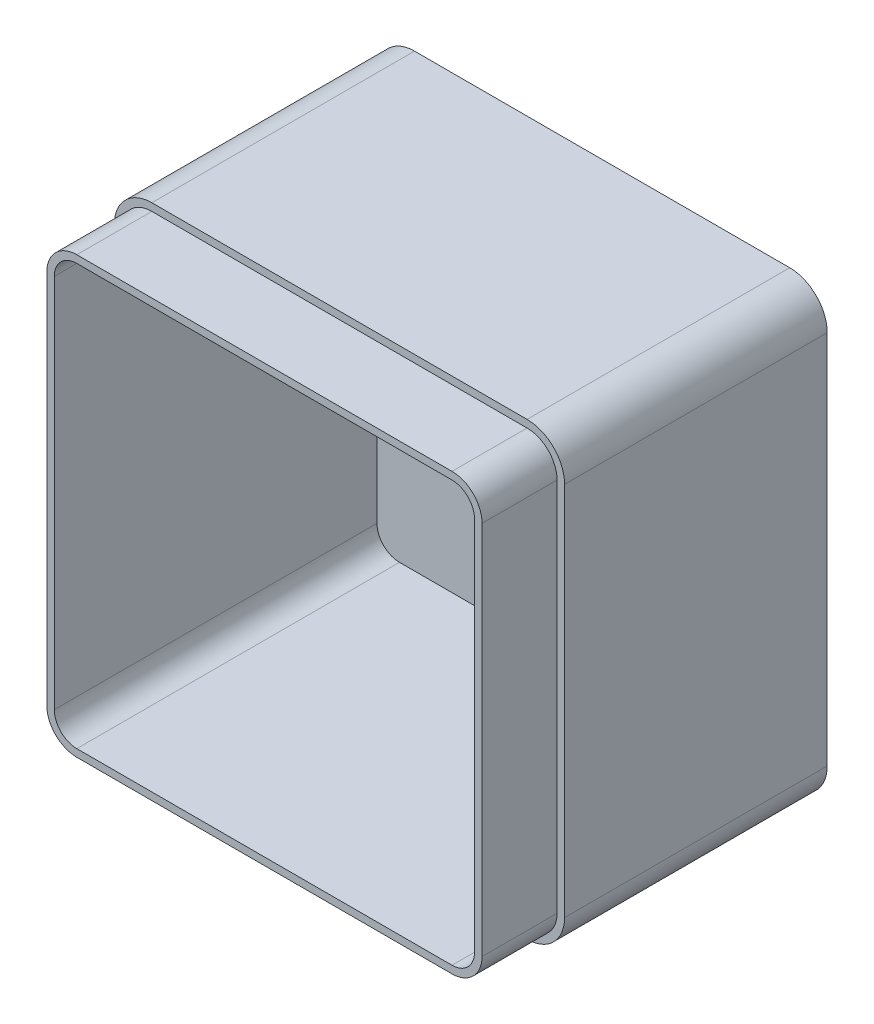
ISO-10303-21;
HEADER;
FILE_DESCRIPTION(('STEP AP214'),'2;1');
FILE_NAME('part.step','',(''),(''),'','','');
FILE_SCHEMA(('AUTOMOTIVE_DESIGN { 1 0 10303 214 1 1 1 1 }'));
ENDSEC;
DATA;
#1=APPLICATION_CONTEXT('core data for automotive mechanical design processes');
#2=APPLICATION_PROTOCOL_DEFINITION('international standard','automotive_design',2000,#1);
#3=PRODUCT_CONTEXT('',#1,'mechanical');
#4=PRODUCT('Part','Part','',(#3));
#5=PRODUCT_RELATED_PRODUCT_CATEGORY('part','',(#4));
#6=PRODUCT_DEFINITION_FORMATION('','',#4);
#7=PRODUCT_DEFINITION_CONTEXT('part definition',#1,'design');
#8=PRODUCT_DEFINITION('design','',#6,#7);
#9=PRODUCT_DEFINITION_SHAPE('','',#8);
#10=(LENGTH_UNIT() NAMED_UNIT(*) SI_UNIT(.MILLI.,.METRE.));
#11=(NAMED_UNIT(*) PLANE_ANGLE_UNIT() SI_UNIT($,.RADIAN.));
#12=(NAMED_UNIT(*) SI_UNIT($,.STERADIAN.) SOLID_ANGLE_UNIT());
#13=UNCERTAINTY_MEASURE_WITH_UNIT(LENGTH_MEASURE(1.E-05),#10,'distance_accuracy_value','');
#14=(GEOMETRIC_REPRESENTATION_CONTEXT(3) GLOBAL_UNCERTAINTY_ASSIGNED_CONTEXT((#13)) GLOBAL_UNIT_ASSIGNED_CONTEXT((#10,
#11,#12)) REPRESENTATION_CONTEXT('',''));
#15=CARTESIAN_POINT('',(0.,0.,0.));
#16=DIRECTION('',(0.,0.,1.));
#17=DIRECTION('',(1.,0.,0.));
#18=AXIS2_PLACEMENT_3D('',#15,#16,#17);
#19=CARTESIAN_POINT('',(0.,0.,90.));
#20=DIRECTION('',(0.,0.,1.));
#21=DIRECTION('',(1.,0.,0.));
#22=AXIS2_PLACEMENT_3D('',#19,#20,#21);
#23=PLANE('',#22);
#24=DIRECTION('',(0.,-1.,0.));
#25=VECTOR('',#24,1.);
#26=CARTESIAN_POINT('',(-56.,60.,90.));
#27=LINE('',#26,#25);
#28=CARTESIAN_POINT('',(-56.,50.,90.));
#29=VERTEX_POINT('',#28);
#30=CARTESIAN_POINT('',(-56.,-50.,90.));
#31=VERTEX_POINT('',#30);
#32=EDGE_CURVE('E391',#29,#31,#27,.T.);
#33=ORIENTED_EDGE('',*,*,#32,.F.);
#34=CARTESIAN_POINT('',(-50.,50.,90.));
#35=DIRECTION('',(0.,0.,1.));
#36=DIRECTION('',(1.,0.,0.));
#37=AXIS2_PLACEMENT_3D('',#34,#35,#36);
#38=CIRCLE('',#37,6.);
#39=CARTESIAN_POINT('',(-50.,56.,90.));
#40=VERTEX_POINT('',#39);
#41=EDGE_CURVE('E388',#40,#29,#38,.T.);
#42=ORIENTED_EDGE('',*,*,#41,.F.);
#43=DIRECTION('',(-1.,0.,0.));
#44=VECTOR('',#43,1.);
#45=CARTESIAN_POINT('',(-60.,56.,90.));
#46=LINE('',#45,#44);
#47=CARTESIAN_POINT('',(50.,56.,90.));
#48=VERTEX_POINT('',#47);
#49=EDGE_CURVE('E385',#48,#40,#46,.T.);
#50=ORIENTED_EDGE('',*,*,#49,.F.);
#51=CARTESIAN_POINT('',(50.,50.,90.));
#52=DIRECTION('',(0.,0.,1.));
#53=DIRECTION('',(1.,0.,0.));
#54=AXIS2_PLACEMENT_3D('',#51,#52,#53);
#55=CIRCLE('',#54,6.);
#56=CARTESIAN_POINT('',(56.,50.,90.));
#57=VERTEX_POINT('',#56);
#58=EDGE_CURVE('E374',#57,#48,#55,.T.);
#59=ORIENTED_EDGE('',*,*,#58,.F.);
#60=DIRECTION('',(0.,1.,0.));
#61=VECTOR('',#60,1.);
#62=CARTESIAN_POINT('',(56.,60.,90.));
#63=LINE('',#62,#61);
#64=CARTESIAN_POINT('',(56.,-50.,90.));
#65=VERTEX_POINT('',#64);
#66=EDGE_CURVE('E338',#65,#57,#63,.T.);
#67=ORIENTED_EDGE('',*,*,#66,.F.);
#68=CARTESIAN_POINT('',(50.,-50.,90.));
#69=DIRECTION('',(0.,0.,1.));
#70=DIRECTION('',(1.,0.,0.));
#71=AXIS2_PLACEMENT_3D('',#68,#69,#70);
#72=CIRCLE('',#71,6.);
#73=CARTESIAN_POINT('',(50.,-56.,90.));
#74=VERTEX_POINT('',#73);
#75=EDGE_CURVE('E394',#74,#65,#72,.T.);
#76=ORIENTED_EDGE('',*,*,#75,.F.);
#77=DIRECTION('',(1.,0.,0.));
#78=VECTOR('',#77,1.);
#79=CARTESIAN_POINT('',(-60.,-56.,90.));
#80=LINE('',#79,#78);
#81=CARTESIAN_POINT('',(-50.,-56.,90.));
#82=VERTEX_POINT('',#81);
#83=EDGE_CURVE('E381',#82,#74,#80,.T.);
#84=ORIENTED_EDGE('',*,*,#83,.F.);
#85=CARTESIAN_POINT('',(-50.,-50.,90.));
#86=DIRECTION('',(0.,0.,1.));
#87=DIRECTION('',(1.,0.,0.));
#88=AXIS2_PLACEMENT_3D('',#85,#86,#87);
#89=CIRCLE('',#88,6.);
#90=EDGE_CURVE('E333',#31,#82,#89,.T.);
#91=ORIENTED_EDGE('',*,*,#90,.F.);
#92=EDGE_LOOP('',(#33,#42,#50,#59,#67,#76,#84,#91));
#93=FACE_BOUND('',#92,.T.);
#94=DIRECTION('',(-1.,0.,0.));
#95=VECTOR('',#94,1.);
#96=CARTESIAN_POINT('',(50.,58.,90.));
#97=LINE('',#96,#95);
#98=CARTESIAN_POINT('',(50.,58.,90.));
#99=VERTEX_POINT('',#98);
#100=CARTESIAN_POINT('',(-50.,58.,90.));
#101=VERTEX_POINT('',#100);
#102=EDGE_CURVE('E229',#99,#101,#97,.T.);
#103=ORIENTED_EDGE('',*,*,#102,.T.);
#104=CARTESIAN_POINT('',(-50.,50.,90.));
#105=DIRECTION('',(0.,0.,1.));
#106=DIRECTION('',(1.,0.,0.));
#107=AXIS2_PLACEMENT_3D('',#104,#105,#106);
#108=CIRCLE('',#107,7.99999999999999);
#109=CARTESIAN_POINT('',(-58.,50.,90.));
#110=VERTEX_POINT('',#109);
#111=EDGE_CURVE('E256',#101,#110,#108,.T.);
#112=ORIENTED_EDGE('',*,*,#111,.T.);
#113=DIRECTION('',(0.,-1.,0.));
#114=VECTOR('',#113,1.);
#115=CARTESIAN_POINT('',(-58.,50.,90.));
#116=LINE('',#115,#114);
#117=CARTESIAN_POINT('',(-58.,-50.,90.));
#118=VERTEX_POINT('',#117);
#119=EDGE_CURVE('E206',#110,#118,#116,.T.);
#120=ORIENTED_EDGE('',*,*,#119,.T.);
#121=CARTESIAN_POINT('',(-50.,-50.,90.));
#122=DIRECTION('',(0.,0.,1.));
#123=DIRECTION('',(1.,0.,0.));
#124=AXIS2_PLACEMENT_3D('',#121,#122,#123);
#125=CIRCLE('',#124,8.);
#126=CARTESIAN_POINT('',(-50.,-58.,90.));
#127=VERTEX_POINT('',#126);
#128=EDGE_CURVE('E54',#118,#127,#125,.T.);
#129=ORIENTED_EDGE('',*,*,#128,.T.);
#130=DIRECTION('',(1.,0.,0.));
#131=VECTOR('',#130,1.);
#132=CARTESIAN_POINT('',(-50.,-58.,90.));
#133=LINE('',#132,#131);
#134=CARTESIAN_POINT('',(50.,-58.,90.));
#135=VERTEX_POINT('',#134);
#136=EDGE_CURVE('E263',#127,#135,#133,.T.);
#137=ORIENTED_EDGE('',*,*,#136,.T.);
#138=CARTESIAN_POINT('',(50.,-50.,90.));
#139=DIRECTION('',(0.,0.,1.));
#140=DIRECTION('',(1.,0.,0.));
#141=AXIS2_PLACEMENT_3D('',#138,#139,#140);
#142=CIRCLE('',#141,7.99999999999999);
#143=CARTESIAN_POINT('',(58.,-50.,90.));
#144=VERTEX_POINT('',#143);
#145=EDGE_CURVE('E267',#135,#144,#142,.T.);
#146=ORIENTED_EDGE('',*,*,#145,.T.);
#147=DIRECTION('',(0.,1.,0.));
#148=VECTOR('',#147,1.);
#149=CARTESIAN_POINT('',(58.,-50.,90.));
#150=LINE('',#149,#148);
#151=CARTESIAN_POINT('',(58.,50.,90.));
#152=VERTEX_POINT('',#151);
#153=EDGE_CURVE('E271',#144,#152,#150,.T.);
#154=ORIENTED_EDGE('',*,*,#153,.T.);
#155=CARTESIAN_POINT('',(50.,50.,90.));
#156=DIRECTION('',(0.,0.,1.));
#157=DIRECTION('',(1.,0.,0.));
#158=AXIS2_PLACEMENT_3D('',#155,#156,#157);
#159=CIRCLE('',#158,8.);
#160=EDGE_CURVE('E233',#152,#99,#159,.T.);
#161=ORIENTED_EDGE('',*,*,#160,.T.);
#162=EDGE_LOOP('',(#103,#112,#120,#129,#137,#146,#154,#161));
#163=FACE_BOUND('',#162,.T.);
#164=ADVANCED_FACE('F38',(#93,#163),#23,.T.);
#165=CARTESIAN_POINT('',(56.,60.,90.));
#166=DIRECTION('',(-1.,0.,0.));
#167=DIRECTION('',(0.,-1.,0.));
#168=AXIS2_PLACEMENT_3D('',#165,#166,#167);
#169=PLANE('',#168);
#170=ORIENTED_EDGE('',*,*,#66,.T.);
#171=DIRECTION('',(0.,0.,1.));
#172=VECTOR('',#171,1.);
#173=CARTESIAN_POINT('',(56.,50.,90.));
#174=LINE('',#173,#172);
#175=CARTESIAN_POINT('',(56.,50.,4.));
#176=VERTEX_POINT('',#175);
#177=EDGE_CURVE('E326',#176,#57,#174,.T.);
#178=ORIENTED_EDGE('',*,*,#177,.F.);
#179=DIRECTION('',(0.,1.,0.));
#180=VECTOR('',#179,1.);
#181=CARTESIAN_POINT('',(56.,60.,4.));
#182=LINE('',#181,#180);
#183=CARTESIAN_POINT('',(56.,-50.,4.));
#184=VERTEX_POINT('',#183);
#185=EDGE_CURVE('E320',#184,#176,#182,.T.);
#186=ORIENTED_EDGE('',*,*,#185,.F.);
#187=DIRECTION('',(0.,0.,1.));
#188=VECTOR('',#187,1.);
#189=CARTESIAN_POINT('',(56.,-50.,90.));
#190=LINE('',#189,#188);
#191=EDGE_CURVE('E321',#65,#184,#190,.F.);
#192=ORIENTED_EDGE('',*,*,#191,.F.);
#193=EDGE_LOOP('',(#170,#178,#186,#192));
#194=FACE_BOUND('',#193,.T.);
#195=ADVANCED_FACE('F500',(#194),#169,.T.);
#196=CARTESIAN_POINT('',(-60.,56.,90.));
#197=DIRECTION('',(0.,-1.,0.));
#198=DIRECTION('',(0.,0.,-1.));
#199=AXIS2_PLACEMENT_3D('',#196,#197,#198);
#200=PLANE('',#199);
#201=DIRECTION('',(-1.,0.,0.));
#202=VECTOR('',#201,1.);
#203=CARTESIAN_POINT('',(-60.,56.,4.));
#204=LINE('',#203,#202);
#205=CARTESIAN_POINT('',(50.,56.,4.));
#206=VERTEX_POINT('',#205);
#207=CARTESIAN_POINT('',(-50.,56.,4.));
#208=VERTEX_POINT('',#207);
#209=EDGE_CURVE('E330',#206,#208,#204,.T.);
#210=ORIENTED_EDGE('',*,*,#209,.F.);
#211=DIRECTION('',(0.,0.,-1.));
#212=VECTOR('',#211,1.);
#213=CARTESIAN_POINT('',(50.,56.,90.));
#214=LINE('',#213,#212);
#215=EDGE_CURVE('E325',#48,#206,#214,.T.);
#216=ORIENTED_EDGE('',*,*,#215,.F.);
#217=ORIENTED_EDGE('',*,*,#49,.T.);
#218=DIRECTION('',(0.,0.,-1.));
#219=VECTOR('',#218,1.);
#220=CARTESIAN_POINT('',(-50.,56.,90.));
#221=LINE('',#220,#219);
#222=EDGE_CURVE('E360',#208,#40,#221,.F.);
#223=ORIENTED_EDGE('',*,*,#222,.F.);
#224=EDGE_LOOP('',(#210,#216,#217,#223));
#225=FACE_BOUND('',#224,.T.);
#226=ADVANCED_FACE('F508',(#225),#200,.T.);
#227=CARTESIAN_POINT('',(-56.,60.,90.));
#228=DIRECTION('',(1.,0.,0.));
#229=DIRECTION('',(0.,1.,0.));
#230=AXIS2_PLACEMENT_3D('',#227,#228,#229);
#231=PLANE('',#230);
#232=DIRECTION('',(0.,-1.,0.));
#233=VECTOR('',#232,1.);
#234=CARTESIAN_POINT('',(-56.,60.,4.));
#235=LINE('',#234,#233);
#236=CARTESIAN_POINT('',(-56.,50.,4.));
#237=VERTEX_POINT('',#236);
#238=CARTESIAN_POINT('',(-56.,-50.,4.));
#239=VERTEX_POINT('',#238);
#240=EDGE_CURVE('E339',#237,#239,#235,.T.);
#241=ORIENTED_EDGE('',*,*,#240,.F.);
#242=DIRECTION('',(0.,0.,1.));
#243=VECTOR('',#242,1.);
#244=CARTESIAN_POINT('',(-56.,50.,90.));
#245=LINE('',#244,#243);
#246=EDGE_CURVE('E343',#29,#237,#245,.F.);
#247=ORIENTED_EDGE('',*,*,#246,.F.);
#248=ORIENTED_EDGE('',*,*,#32,.T.);
#249=DIRECTION('',(0.,0.,1.));
#250=VECTOR('',#249,1.);
#251=CARTESIAN_POINT('',(-56.,-50.,90.));
#252=LINE('',#251,#250);
#253=EDGE_CURVE('E371',#239,#31,#252,.T.);
#254=ORIENTED_EDGE('',*,*,#253,.F.);
#255=EDGE_LOOP('',(#241,#247,#248,#254));
#256=FACE_BOUND('',#255,.T.);
#257=ADVANCED_FACE('F646',(#256),#231,.T.);
#258=CARTESIAN_POINT('',(-60.,-56.,90.));
#259=DIRECTION('',(0.,1.,0.));
#260=DIRECTION('',(0.,0.,1.));
#261=AXIS2_PLACEMENT_3D('',#258,#259,#260);
#262=PLANE('',#261);
#263=ORIENTED_EDGE('',*,*,#83,.T.);
#264=DIRECTION('',(0.,0.,1.));
#265=VECTOR('',#264,1.);
#266=CARTESIAN_POINT('',(50.,-56.,90.));
#267=LINE('',#266,#265);
#268=CARTESIAN_POINT('',(50.,-56.,4.));
#269=VERTEX_POINT('',#268);
#270=EDGE_CURVE('E378',#269,#74,#267,.T.);
#271=ORIENTED_EDGE('',*,*,#270,.F.);
#272=DIRECTION('',(1.,0.,0.));
#273=VECTOR('',#272,1.);
#274=CARTESIAN_POINT('',(-60.,-56.,4.));
#275=LINE('',#274,#273);
#276=CARTESIAN_POINT('',(-50.,-56.,4.));
#277=VERTEX_POINT('',#276);
#278=EDGE_CURVE('E334',#277,#269,#275,.T.);
#279=ORIENTED_EDGE('',*,*,#278,.F.);
#280=DIRECTION('',(0.,0.,1.));
#281=VECTOR('',#280,1.);
#282=CARTESIAN_POINT('',(-50.,-56.,90.));
#283=LINE('',#282,#281);
#284=EDGE_CURVE('E357',#82,#277,#283,.F.);
#285=ORIENTED_EDGE('',*,*,#284,.F.);
#286=EDGE_LOOP('',(#263,#271,#279,#285));
#287=FACE_BOUND('',#286,.T.);
#288=ADVANCED_FACE('F650',(#287),#262,.T.);
#289=CARTESIAN_POINT('',(0.,0.,4.));
#290=DIRECTION('',(0.,0.,1.));
#291=DIRECTION('',(1.,0.,0.));
#292=AXIS2_PLACEMENT_3D('',#289,#290,#291);
#293=PLANE('',#292);
#294=ORIENTED_EDGE('',*,*,#278,.T.);
#295=CARTESIAN_POINT('',(50.,-50.,4.));
#296=DIRECTION('',(0.,0.,1.));
#297=DIRECTION('',(1.,0.,0.));
#298=AXIS2_PLACEMENT_3D('',#295,#296,#297);
#299=CIRCLE('',#298,6.);
#300=EDGE_CURVE('E344',#184,#269,#299,.F.);
#301=ORIENTED_EDGE('',*,*,#300,.F.);
#302=ORIENTED_EDGE('',*,*,#185,.T.);
#303=CARTESIAN_POINT('',(50.,50.,4.));
#304=DIRECTION('',(0.,0.,1.));
#305=DIRECTION('',(1.,0.,0.));
#306=AXIS2_PLACEMENT_3D('',#303,#304,#305);
#307=CIRCLE('',#306,6.);
#308=EDGE_CURVE('E351',#206,#176,#307,.F.);
#309=ORIENTED_EDGE('',*,*,#308,.F.);
#310=ORIENTED_EDGE('',*,*,#209,.T.);
#311=CARTESIAN_POINT('',(-50.,50.,4.));
#312=DIRECTION('',(0.,0.,1.));
#313=DIRECTION('',(1.,0.,0.));
#314=AXIS2_PLACEMENT_3D('',#311,#312,#313);
#315=CIRCLE('',#314,6.);
#316=EDGE_CURVE('E348',#237,#208,#315,.F.);
#317=ORIENTED_EDGE('',*,*,#316,.F.);
#318=ORIENTED_EDGE('',*,*,#240,.T.);
#319=CARTESIAN_POINT('',(-50.,-50.,4.));
#320=DIRECTION('',(0.,0.,1.));
#321=DIRECTION('',(1.,0.,0.));
#322=AXIS2_PLACEMENT_3D('',#319,#320,#321);
#323=CIRCLE('',#322,6.);
#324=EDGE_CURVE('E340',#277,#239,#323,.F.);
#325=ORIENTED_EDGE('',*,*,#324,.F.);
#326=EDGE_LOOP('',(#294,#301,#302,#309,#310,#317,#318,#325));
#327=FACE_BOUND('',#326,.T.);
#328=ADVANCED_FACE('F654',(#327),#293,.T.);
#329=CARTESIAN_POINT('',(-50.,-50.,90.));
#330=DIRECTION('',(0.,0.,-1.));
#331=DIRECTION('',(-1.,0.,0.));
#332=AXIS2_PLACEMENT_3D('',#329,#330,#331);
#333=CYLINDRICAL_SURFACE('',#332,6.);
#334=ORIENTED_EDGE('',*,*,#90,.T.);
#335=ORIENTED_EDGE('',*,*,#284,.T.);
#336=ORIENTED_EDGE('',*,*,#324,.T.);
#337=ORIENTED_EDGE('',*,*,#253,.T.);
#338=EDGE_LOOP('',(#334,#335,#336,#337));
#339=FACE_BOUND('',#338,.T.);
#340=ADVANCED_FACE('F658',(#339),#333,.F.);
#341=CARTESIAN_POINT('',(50.,-50.,90.));
#342=DIRECTION('',(0.,0.,-1.));
#343=DIRECTION('',(-1.,0.,0.));
#344=AXIS2_PLACEMENT_3D('',#341,#342,#343);
#345=CYLINDRICAL_SURFACE('',#344,6.);
#346=ORIENTED_EDGE('',*,*,#75,.T.);
#347=ORIENTED_EDGE('',*,*,#191,.T.);
#348=ORIENTED_EDGE('',*,*,#300,.T.);
#349=ORIENTED_EDGE('',*,*,#270,.T.);
#350=EDGE_LOOP('',(#346,#347,#348,#349));
#351=FACE_BOUND('',#350,.T.);
#352=ADVANCED_FACE('F662',(#351),#345,.F.);
#353=CARTESIAN_POINT('',(-50.,50.,90.));
#354=DIRECTION('',(0.,0.,-1.));
#355=DIRECTION('',(-1.,0.,0.));
#356=AXIS2_PLACEMENT_3D('',#353,#354,#355);
#357=CYLINDRICAL_SURFACE('',#356,6.);
#358=ORIENTED_EDGE('',*,*,#41,.T.);
#359=ORIENTED_EDGE('',*,*,#246,.T.);
#360=ORIENTED_EDGE('',*,*,#316,.T.);
#361=ORIENTED_EDGE('',*,*,#222,.T.);
#362=EDGE_LOOP('',(#358,#359,#360,#361));
#363=FACE_BOUND('',#362,.T.);
#364=ADVANCED_FACE('F665',(#363),#357,.F.);
#365=CARTESIAN_POINT('',(50.,50.,90.));
#366=DIRECTION('',(0.,0.,-1.));
#367=DIRECTION('',(-1.,0.,0.));
#368=AXIS2_PLACEMENT_3D('',#365,#366,#367);
#369=CYLINDRICAL_SURFACE('',#368,6.);
#370=ORIENTED_EDGE('',*,*,#58,.T.);
#371=ORIENTED_EDGE('',*,*,#215,.T.);
#372=ORIENTED_EDGE('',*,*,#308,.T.);
#373=ORIENTED_EDGE('',*,*,#177,.T.);
#374=EDGE_LOOP('',(#370,#371,#372,#373));
#375=FACE_BOUND('',#374,.T.);
#376=ADVANCED_FACE('F515',(#375),#369,.F.);
#377=CARTESIAN_POINT('',(-50.,50.,70.));
#378=DIRECTION('',(0.,0.,1.));
#379=DIRECTION('',(1.,0.,0.));
#380=AXIS2_PLACEMENT_3D('',#377,#378,#379);
#381=PLANE('',#380);
#382=DIRECTION('',(-1.,0.,0.));
#383=VECTOR('',#382,1.);
#384=CARTESIAN_POINT('',(50.,58.,70.));
#385=LINE('',#384,#383);
#386=CARTESIAN_POINT('',(50.,58.,70.));
#387=VERTEX_POINT('',#386);
#388=CARTESIAN_POINT('',(-50.,58.,70.));
#389=VERTEX_POINT('',#388);
#390=EDGE_CURVE('E213',#387,#389,#385,.T.);
#391=ORIENTED_EDGE('',*,*,#390,.F.);
#392=CARTESIAN_POINT('',(50.,50.,70.));
#393=DIRECTION('',(0.,0.,1.));
#394=DIRECTION('',(1.,0.,0.));
#395=AXIS2_PLACEMENT_3D('',#392,#393,#394);
#396=CIRCLE('',#395,8.);
#397=CARTESIAN_POINT('',(58.,50.,70.));
#398=VERTEX_POINT('',#397);
#399=EDGE_CURVE('E250',#398,#387,#396,.T.);
#400=ORIENTED_EDGE('',*,*,#399,.F.);
#401=DIRECTION('',(0.,1.,0.));
#402=VECTOR('',#401,1.);
#403=CARTESIAN_POINT('',(58.,-50.,70.));
#404=LINE('',#403,#402);
#405=CARTESIAN_POINT('',(58.,-50.,70.));
#406=VERTEX_POINT('',#405);
#407=EDGE_CURVE('E246',#406,#398,#404,.T.);
#408=ORIENTED_EDGE('',*,*,#407,.F.);
#409=CARTESIAN_POINT('',(50.,-50.,70.));
#410=DIRECTION('',(0.,0.,1.));
#411=DIRECTION('',(1.,0.,0.));
#412=AXIS2_PLACEMENT_3D('',#409,#410,#411);
#413=CIRCLE('',#412,7.99999999999999);
#414=CARTESIAN_POINT('',(50.,-58.,70.));
#415=VERTEX_POINT('',#414);
#416=EDGE_CURVE('E242',#415,#406,#413,.T.);
#417=ORIENTED_EDGE('',*,*,#416,.F.);
#418=DIRECTION('',(1.,0.,0.));
#419=VECTOR('',#418,1.);
#420=CARTESIAN_POINT('',(-50.,-58.,70.));
#421=LINE('',#420,#419);
#422=CARTESIAN_POINT('',(-50.,-58.,70.));
#423=VERTEX_POINT('',#422);
#424=EDGE_CURVE('E238',#423,#415,#421,.T.);
#425=ORIENTED_EDGE('',*,*,#424,.F.);
#426=CARTESIAN_POINT('',(-50.,-50.,70.));
#427=DIRECTION('',(0.,0.,1.));
#428=DIRECTION('',(1.,0.,0.));
#429=AXIS2_PLACEMENT_3D('',#426,#427,#428);
#430=CIRCLE('',#429,8.);
#431=CARTESIAN_POINT('',(-58.,-50.,70.));
#432=VERTEX_POINT('',#431);
#433=EDGE_CURVE('E223',#432,#423,#430,.T.);
#434=ORIENTED_EDGE('',*,*,#433,.F.);
#435=DIRECTION('',(0.,-1.,0.));
#436=VECTOR('',#435,1.);
#437=CARTESIAN_POINT('',(-58.,50.,70.));
#438=LINE('',#437,#436);
#439=CARTESIAN_POINT('',(-58.,50.,70.));
#440=VERTEX_POINT('',#439);
#441=EDGE_CURVE('E204',#440,#432,#438,.T.);
#442=ORIENTED_EDGE('',*,*,#441,.F.);
#443=CARTESIAN_POINT('',(-50.,50.,70.));
#444=DIRECTION('',(0.,0.,1.));
#445=DIRECTION('',(1.,0.,0.));
#446=AXIS2_PLACEMENT_3D('',#443,#444,#445);
#447=CIRCLE('',#446,7.99999999999999);
#448=EDGE_CURVE('E219',#389,#440,#447,.T.);
#449=ORIENTED_EDGE('',*,*,#448,.F.);
#450=EDGE_LOOP('',(#391,#400,#408,#417,#425,#434,#442,#449));
#451=FACE_BOUND('',#450,.T.);
#452=CARTESIAN_POINT('',(-50.,50.,70.));
#453=DIRECTION('',(0.,0.,1.));
#454=DIRECTION('',(1.,0.,0.));
#455=AXIS2_PLACEMENT_3D('',#452,#453,#454);
#456=CIRCLE('',#455,9.99999999999999);
#457=CARTESIAN_POINT('',(-50.,60.,70.));
#458=VERTEX_POINT('',#457);
#459=CARTESIAN_POINT('',(-60.,50.,70.));
#460=VERTEX_POINT('',#459);
#461=EDGE_CURVE('E280',#458,#460,#456,.T.);
#462=ORIENTED_EDGE('',*,*,#461,.T.);
#463=DIRECTION('',(0.,-1.,0.));
#464=VECTOR('',#463,1.);
#465=CARTESIAN_POINT('',(-60.,50.,70.));
#466=LINE('',#465,#464);
#467=CARTESIAN_POINT('',(-60.,-50.,70.));
#468=VERTEX_POINT('',#467);
#469=EDGE_CURVE('E300',#460,#468,#466,.T.);
#470=ORIENTED_EDGE('',*,*,#469,.T.);
#471=CARTESIAN_POINT('',(-50.,-50.,70.));
#472=DIRECTION('',(0.,0.,1.));
#473=DIRECTION('',(1.,0.,0.));
#474=AXIS2_PLACEMENT_3D('',#471,#472,#473);
#475=CIRCLE('',#474,9.99999999999999);
#476=CARTESIAN_POINT('',(-50.,-60.,70.));
#477=VERTEX_POINT('',#476);
#478=EDGE_CURVE('E303',#468,#477,#475,.T.);
#479=ORIENTED_EDGE('',*,*,#478,.T.);
#480=DIRECTION('',(1.,0.,0.));
#481=VECTOR('',#480,1.);
#482=CARTESIAN_POINT('',(-50.,-60.,70.));
#483=LINE('',#482,#481);
#484=CARTESIAN_POINT('',(50.,-60.,70.));
#485=VERTEX_POINT('',#484);
#486=EDGE_CURVE('E306',#477,#485,#483,.T.);
#487=ORIENTED_EDGE('',*,*,#486,.T.);
#488=CARTESIAN_POINT('',(50.,-50.,70.));
#489=DIRECTION('',(0.,0.,1.));
#490=DIRECTION('',(1.,0.,0.));
#491=AXIS2_PLACEMENT_3D('',#488,#489,#490);
#492=CIRCLE('',#491,9.99999999999999);
#493=CARTESIAN_POINT('',(60.,-50.,70.));
#494=VERTEX_POINT('',#493);
#495=EDGE_CURVE('E309',#485,#494,#492,.T.);
#496=ORIENTED_EDGE('',*,*,#495,.T.);
#497=DIRECTION('',(0.,1.,0.));
#498=VECTOR('',#497,1.);
#499=CARTESIAN_POINT('',(60.,-50.,70.));
#500=LINE('',#499,#498);
#501=CARTESIAN_POINT('',(60.,50.,70.));
#502=VERTEX_POINT('',#501);
#503=EDGE_CURVE('E62',#494,#502,#500,.T.);
#504=ORIENTED_EDGE('',*,*,#503,.T.);
#505=CARTESIAN_POINT('',(50.,50.,70.));
#506=DIRECTION('',(0.,0.,1.));
#507=DIRECTION('',(1.,0.,0.));
#508=AXIS2_PLACEMENT_3D('',#505,#506,#507);
#509=CIRCLE('',#508,9.99999999999999);
#510=CARTESIAN_POINT('',(50.,60.,70.));
#511=VERTEX_POINT('',#510);
#512=EDGE_CURVE('E314',#502,#511,#509,.T.);
#513=ORIENTED_EDGE('',*,*,#512,.T.);
#514=DIRECTION('',(-1.,0.,0.));
#515=VECTOR('',#514,1.);
#516=CARTESIAN_POINT('',(50.,60.,70.));
#517=LINE('',#516,#515);
#518=EDGE_CURVE('E317',#511,#458,#517,.T.);
#519=ORIENTED_EDGE('',*,*,#518,.T.);
#520=EDGE_LOOP('',(#462,#470,#479,#487,#496,#504,#513,#519));
#521=FACE_BOUND('',#520,.T.);
#522=ADVANCED_FACE('F218',(#451,#521),#381,.T.);
#523=CARTESIAN_POINT('',(-50.,50.,70.));
#524=DIRECTION('',(0.,0.,1.));
#525=DIRECTION('',(1.,0.,0.));
#526=AXIS2_PLACEMENT_3D('',#523,#524,#525);
#527=CYLINDRICAL_SURFACE('',#526,7.99999999999999);
#528=ORIENTED_EDGE('',*,*,#111,.F.);
#529=DIRECTION('',(0.,0.,1.));
#530=VECTOR('',#529,1.);
#531=CARTESIAN_POINT('',(-50.,58.,70.));
#532=LINE('',#531,#530);
#533=EDGE_CURVE('E227',#389,#101,#532,.T.);
#534=ORIENTED_EDGE('',*,*,#533,.F.);
#535=ORIENTED_EDGE('',*,*,#448,.T.);
#536=DIRECTION('',(0.,0.,1.));
#537=VECTOR('',#536,1.);
#538=CARTESIAN_POINT('',(-58.,50.,70.));
#539=LINE('',#538,#537);
#540=EDGE_CURVE('E201',#440,#110,#539,.T.);
#541=ORIENTED_EDGE('',*,*,#540,.T.);
#542=EDGE_LOOP('',(#528,#534,#535,#541));
#543=FACE_BOUND('',#542,.T.);
#544=ADVANCED_FACE('F226',(#543),#527,.T.);
#545=CARTESIAN_POINT('',(50.,58.,70.));
#546=DIRECTION('',(0.,1.,0.));
#547=DIRECTION('',(0.,0.,1.));
#548=AXIS2_PLACEMENT_3D('',#545,#546,#547);
#549=PLANE('',#548);
#550=ORIENTED_EDGE('',*,*,#102,.F.);
#551=DIRECTION('',(0.,0.,1.));
#552=VECTOR('',#551,1.);
#553=CARTESIAN_POINT('',(50.,58.,70.));
#554=LINE('',#553,#552);
#555=EDGE_CURVE('E281',#387,#99,#554,.T.);
#556=ORIENTED_EDGE('',*,*,#555,.F.);
#557=ORIENTED_EDGE('',*,*,#390,.T.);
#558=ORIENTED_EDGE('',*,*,#533,.T.);
#559=EDGE_LOOP('',(#550,#556,#557,#558));
#560=FACE_BOUND('',#559,.T.);
#561=ADVANCED_FACE('F574',(#560),#549,.T.);
#562=CARTESIAN_POINT('',(50.,50.,70.));
#563=DIRECTION('',(0.,0.,1.));
#564=DIRECTION('',(1.,0.,0.));
#565=AXIS2_PLACEMENT_3D('',#562,#563,#564);
#566=CYLINDRICAL_SURFACE('',#565,8.);
#567=ORIENTED_EDGE('',*,*,#160,.F.);
#568=DIRECTION('',(0.,0.,1.));
#569=VECTOR('',#568,1.);
#570=CARTESIAN_POINT('',(58.,50.,70.));
#571=LINE('',#570,#569);
#572=EDGE_CURVE('E284',#398,#152,#571,.T.);
#573=ORIENTED_EDGE('',*,*,#572,.F.);
#574=ORIENTED_EDGE('',*,*,#399,.T.);
#575=ORIENTED_EDGE('',*,*,#555,.T.);
#576=EDGE_LOOP('',(#567,#573,#574,#575));
#577=FACE_BOUND('',#576,.T.);
#578=ADVANCED_FACE('F582',(#577),#566,.T.);
#579=CARTESIAN_POINT('',(58.,-50.,70.));
#580=DIRECTION('',(1.,0.,0.));
#581=DIRECTION('',(0.,0.,-1.));
#582=AXIS2_PLACEMENT_3D('',#579,#580,#581);
#583=PLANE('',#582);
#584=ORIENTED_EDGE('',*,*,#153,.F.);
#585=DIRECTION('',(0.,0.,1.));
#586=VECTOR('',#585,1.);
#587=CARTESIAN_POINT('',(58.,-50.,70.));
#588=LINE('',#587,#586);
#589=EDGE_CURVE('E287',#406,#144,#588,.T.);
#590=ORIENTED_EDGE('',*,*,#589,.F.);
#591=ORIENTED_EDGE('',*,*,#407,.T.);
#592=ORIENTED_EDGE('',*,*,#572,.T.);
#593=EDGE_LOOP('',(#584,#590,#591,#592));
#594=FACE_BOUND('',#593,.T.);
#595=ADVANCED_FACE('F591',(#594),#583,.T.);
#596=CARTESIAN_POINT('',(50.,-50.,70.));
#597=DIRECTION('',(0.,0.,1.));
#598=DIRECTION('',(1.,0.,0.));
#599=AXIS2_PLACEMENT_3D('',#596,#597,#598);
#600=CYLINDRICAL_SURFACE('',#599,7.99999999999999);
#601=ORIENTED_EDGE('',*,*,#145,.F.);
#602=DIRECTION('',(0.,0.,1.));
#603=VECTOR('',#602,1.);
#604=CARTESIAN_POINT('',(50.,-58.,70.));
#605=LINE('',#604,#603);
#606=EDGE_CURVE('E290',#415,#135,#605,.T.);
#607=ORIENTED_EDGE('',*,*,#606,.F.);
#608=ORIENTED_EDGE('',*,*,#416,.T.);
#609=ORIENTED_EDGE('',*,*,#589,.T.);
#610=EDGE_LOOP('',(#601,#607,#608,#609));
#611=FACE_BOUND('',#610,.T.);
#612=ADVANCED_FACE('F600',(#611),#600,.T.);
#613=CARTESIAN_POINT('',(-50.,-58.,70.));
#614=DIRECTION('',(0.,-1.,0.));
#615=DIRECTION('',(0.,0.,-1.));
#616=AXIS2_PLACEMENT_3D('',#613,#614,#615);
#617=PLANE('',#616);
#618=ORIENTED_EDGE('',*,*,#136,.F.);
#619=DIRECTION('',(0.,0.,1.));
#620=VECTOR('',#619,1.);
#621=CARTESIAN_POINT('',(-50.,-58.,70.));
#622=LINE('',#621,#620);
#623=EDGE_CURVE('E293',#423,#127,#622,.T.);
#624=ORIENTED_EDGE('',*,*,#623,.F.);
#625=ORIENTED_EDGE('',*,*,#424,.T.);
#626=ORIENTED_EDGE('',*,*,#606,.T.);
#627=EDGE_LOOP('',(#618,#624,#625,#626));
#628=FACE_BOUND('',#627,.T.);
#629=ADVANCED_FACE('F609',(#628),#617,.T.);
#630=CARTESIAN_POINT('',(-50.,-50.,70.));
#631=DIRECTION('',(0.,0.,1.));
#632=DIRECTION('',(1.,0.,0.));
#633=AXIS2_PLACEMENT_3D('',#630,#631,#632);
#634=CYLINDRICAL_SURFACE('',#633,8.);
#635=ORIENTED_EDGE('',*,*,#128,.F.);
#636=DIRECTION('',(0.,0.,1.));
#637=VECTOR('',#636,1.);
#638=CARTESIAN_POINT('',(-58.,-50.,70.));
#639=LINE('',#638,#637);
#640=EDGE_CURVE('E212',#432,#118,#639,.T.);
#641=ORIENTED_EDGE('',*,*,#640,.F.);
#642=ORIENTED_EDGE('',*,*,#433,.T.);
#643=ORIENTED_EDGE('',*,*,#623,.T.);
#644=EDGE_LOOP('',(#635,#641,#642,#643));
#645=FACE_BOUND('',#644,.T.);
#646=ADVANCED_FACE('F618',(#645),#634,.T.);
#647=CARTESIAN_POINT('',(-58.,50.,70.));
#648=DIRECTION('',(-1.,0.,0.));
#649=DIRECTION('',(0.,0.,1.));
#650=AXIS2_PLACEMENT_3D('',#647,#648,#649);
#651=PLANE('',#650);
#652=ORIENTED_EDGE('',*,*,#119,.F.);
#653=ORIENTED_EDGE('',*,*,#540,.F.);
#654=ORIENTED_EDGE('',*,*,#441,.T.);
#655=ORIENTED_EDGE('',*,*,#640,.T.);
#656=EDGE_LOOP('',(#652,#653,#654,#655));
#657=FACE_BOUND('',#656,.T.);
#658=ADVANCED_FACE('F203',(#657),#651,.T.);
#659=CARTESIAN_POINT('',(0.,0.,0.));
#660=DIRECTION('',(0.,0.,1.));
#661=DIRECTION('',(1.,0.,0.));
#662=AXIS2_PLACEMENT_3D('',#659,#660,#661);
#663=PLANE('',#662);
#664=DIRECTION('',(1.,0.,0.));
#665=VECTOR('',#664,1.);
#666=CARTESIAN_POINT('',(-60.,-60.,0.));
#667=LINE('',#666,#665);
#668=CARTESIAN_POINT('',(-50.,-60.,0.));
#669=VERTEX_POINT('',#668);
#670=CARTESIAN_POINT('',(50.,-60.,0.));
#671=VERTEX_POINT('',#670);
#672=EDGE_CURVE('E416',#669,#671,#667,.T.);
#673=ORIENTED_EDGE('',*,*,#672,.F.);
#674=CARTESIAN_POINT('',(-50.,-50.,0.));
#675=DIRECTION('',(0.,0.,1.));
#676=DIRECTION('',(1.,0.,0.));
#677=AXIS2_PLACEMENT_3D('',#674,#675,#676);
#678=CIRCLE('',#677,10.);
#679=CARTESIAN_POINT('',(-60.,-50.,0.));
#680=VERTEX_POINT('',#679);
#681=EDGE_CURVE('E436',#669,#680,#678,.F.);
#682=ORIENTED_EDGE('',*,*,#681,.T.);
#683=DIRECTION('',(0.,-1.,0.));
#684=VECTOR('',#683,1.);
#685=CARTESIAN_POINT('',(-60.,60.,0.));
#686=LINE('',#685,#684);
#687=CARTESIAN_POINT('',(-60.,50.,0.));
#688=VERTEX_POINT('',#687);
#689=EDGE_CURVE('E412',#688,#680,#686,.T.);
#690=ORIENTED_EDGE('',*,*,#689,.F.);
#691=CARTESIAN_POINT('',(-50.,50.,0.));
#692=DIRECTION('',(0.,0.,1.));
#693=DIRECTION('',(1.,0.,0.));
#694=AXIS2_PLACEMENT_3D('',#691,#692,#693);
#695=CIRCLE('',#694,10.);
#696=CARTESIAN_POINT('',(-50.,60.,0.));
#697=VERTEX_POINT('',#696);
#698=EDGE_CURVE('E430',#688,#697,#695,.F.);
#699=ORIENTED_EDGE('',*,*,#698,.T.);
#700=DIRECTION('',(-1.,0.,0.));
#701=VECTOR('',#700,1.);
#702=CARTESIAN_POINT('',(-60.,60.,0.));
#703=LINE('',#702,#701);
#704=CARTESIAN_POINT('',(50.,60.,0.));
#705=VERTEX_POINT('',#704);
#706=EDGE_CURVE('E408',#705,#697,#703,.T.);
#707=ORIENTED_EDGE('',*,*,#706,.F.);
#708=CARTESIAN_POINT('',(50.,50.,0.));
#709=DIRECTION('',(0.,0.,1.));
#710=DIRECTION('',(1.,0.,0.));
#711=AXIS2_PLACEMENT_3D('',#708,#709,#710);
#712=CIRCLE('',#711,10.);
#713=CARTESIAN_POINT('',(60.,50.,0.));
#714=VERTEX_POINT('',#713);
#715=EDGE_CURVE('E427',#705,#714,#712,.F.);
#716=ORIENTED_EDGE('',*,*,#715,.T.);
#717=DIRECTION('',(0.,1.,0.));
#718=VECTOR('',#717,1.);
#719=CARTESIAN_POINT('',(60.,60.,0.));
#720=LINE('',#719,#718);
#721=CARTESIAN_POINT('',(60.,-50.,0.));
#722=VERTEX_POINT('',#721);
#723=EDGE_CURVE('E364',#722,#714,#720,.T.);
#724=ORIENTED_EDGE('',*,*,#723,.F.);
#725=CARTESIAN_POINT('',(50.,-50.,0.));
#726=DIRECTION('',(0.,0.,1.));
#727=DIRECTION('',(1.,0.,0.));
#728=AXIS2_PLACEMENT_3D('',#725,#726,#727);
#729=CIRCLE('',#728,10.);
#730=EDGE_CURVE('E433',#722,#671,#729,.F.);
#731=ORIENTED_EDGE('',*,*,#730,.T.);
#732=EDGE_LOOP('',(#673,#682,#690,#699,#707,#716,#724,#731));
#733=FACE_BOUND('',#732,.T.);
#734=ADVANCED_FACE('F465',(#733),#663,.F.);
#735=CARTESIAN_POINT('',(50.,-50.,90.));
#736=DIRECTION('',(0.,0.,-1.));
#737=DIRECTION('',(-1.,0.,0.));
#738=AXIS2_PLACEMENT_3D('',#735,#736,#737);
#739=CYLINDRICAL_SURFACE('',#738,10.);
#740=DIRECTION('',(0.,0.,-1.));
#741=VECTOR('',#740,1.);
#742=CARTESIAN_POINT('',(60.,-50.,90.));
#743=LINE('',#742,#741);
#744=EDGE_CURVE('E450',#494,#722,#743,.T.);
#745=ORIENTED_EDGE('',*,*,#744,.F.);
#746=ORIENTED_EDGE('',*,*,#495,.F.);
#747=DIRECTION('',(0.,0.,-1.));
#748=VECTOR('',#747,1.);
#749=CARTESIAN_POINT('',(50.,-60.,90.));
#750=LINE('',#749,#748);
#751=EDGE_CURVE('E420',#671,#485,#750,.F.);
#752=ORIENTED_EDGE('',*,*,#751,.F.);
#753=ORIENTED_EDGE('',*,*,#730,.F.);
#754=EDGE_LOOP('',(#745,#746,#752,#753));
#755=FACE_BOUND('',#754,.T.);
#756=ADVANCED_FACE('F489',(#755),#739,.T.);
#757=CARTESIAN_POINT('',(-50.,-50.,90.));
#758=DIRECTION('',(0.,0.,-1.));
#759=DIRECTION('',(-1.,0.,0.));
#760=AXIS2_PLACEMENT_3D('',#757,#758,#759);
#761=CYLINDRICAL_SURFACE('',#760,10.);
#762=DIRECTION('',(0.,0.,-1.));
#763=VECTOR('',#762,1.);
#764=CARTESIAN_POINT('',(-50.,-60.,90.));
#765=LINE('',#764,#763);
#766=EDGE_CURVE('E424',#477,#669,#765,.T.);
#767=ORIENTED_EDGE('',*,*,#766,.F.);
#768=ORIENTED_EDGE('',*,*,#478,.F.);
#769=DIRECTION('',(0.,0.,-1.));
#770=VECTOR('',#769,1.);
#771=CARTESIAN_POINT('',(-60.,-50.,90.));
#772=LINE('',#771,#770);
#773=EDGE_CURVE('E442',#680,#468,#772,.F.);
#774=ORIENTED_EDGE('',*,*,#773,.F.);
#775=ORIENTED_EDGE('',*,*,#681,.F.);
#776=EDGE_LOOP('',(#767,#768,#774,#775));
#777=FACE_BOUND('',#776,.T.);
#778=ADVANCED_FACE('F480',(#777),#761,.T.);
#779=CARTESIAN_POINT('',(-60.,-60.,90.));
#780=DIRECTION('',(0.,1.,0.));
#781=DIRECTION('',(0.,0.,1.));
#782=AXIS2_PLACEMENT_3D('',#779,#780,#781);
#783=PLANE('',#782);
#784=ORIENTED_EDGE('',*,*,#486,.F.);
#785=ORIENTED_EDGE('',*,*,#766,.T.);
#786=ORIENTED_EDGE('',*,*,#672,.T.);
#787=ORIENTED_EDGE('',*,*,#751,.T.);
#788=EDGE_LOOP('',(#784,#785,#786,#787));
#789=FACE_BOUND('',#788,.T.);
#790=ADVANCED_FACE('F484',(#789),#783,.F.);
#791=CARTESIAN_POINT('',(-50.,50.,90.));
#792=DIRECTION('',(0.,0.,-1.));
#793=DIRECTION('',(-1.,0.,0.));
#794=AXIS2_PLACEMENT_3D('',#791,#792,#793);
#795=CYLINDRICAL_SURFACE('',#794,10.);
#796=DIRECTION('',(0.,0.,-1.));
#797=VECTOR('',#796,1.);
#798=CARTESIAN_POINT('',(-60.,50.,90.));
#799=LINE('',#798,#797);
#800=EDGE_CURVE('E439',#460,#688,#799,.T.);
#801=ORIENTED_EDGE('',*,*,#800,.F.);
#802=ORIENTED_EDGE('',*,*,#461,.F.);
#803=DIRECTION('',(0.,0.,-1.));
#804=VECTOR('',#803,1.);
#805=CARTESIAN_POINT('',(-50.,60.,90.));
#806=LINE('',#805,#804);
#807=EDGE_CURVE('E11',#697,#458,#806,.F.);
#808=ORIENTED_EDGE('',*,*,#807,.F.);
#809=ORIENTED_EDGE('',*,*,#698,.F.);
#810=EDGE_LOOP('',(#801,#802,#808,#809));
#811=FACE_BOUND('',#810,.T.);
#812=ADVANCED_FACE('F470',(#811),#795,.T.);
#813=CARTESIAN_POINT('',(-60.,60.,90.));
#814=DIRECTION('',(1.,0.,0.));
#815=DIRECTION('',(0.,1.,0.));
#816=AXIS2_PLACEMENT_3D('',#813,#814,#815);
#817=PLANE('',#816);
#818=ORIENTED_EDGE('',*,*,#469,.F.);
#819=ORIENTED_EDGE('',*,*,#800,.T.);
#820=ORIENTED_EDGE('',*,*,#689,.T.);
#821=ORIENTED_EDGE('',*,*,#773,.T.);
#822=EDGE_LOOP('',(#818,#819,#820,#821));
#823=FACE_BOUND('',#822,.T.);
#824=ADVANCED_FACE('F475',(#823),#817,.F.);
#825=CARTESIAN_POINT('',(50.,50.,90.));
#826=DIRECTION('',(0.,0.,-1.));
#827=DIRECTION('',(-1.,0.,0.));
#828=AXIS2_PLACEMENT_3D('',#825,#826,#827);
#829=CYLINDRICAL_SURFACE('',#828,10.);
#830=DIRECTION('',(0.,0.,-1.));
#831=VECTOR('',#830,1.);
#832=CARTESIAN_POINT('',(50.,60.,90.));
#833=LINE('',#832,#831);
#834=EDGE_CURVE('E47',#511,#705,#833,.T.);
#835=ORIENTED_EDGE('',*,*,#834,.F.);
#836=ORIENTED_EDGE('',*,*,#512,.F.);
#837=DIRECTION('',(0.,0.,-1.));
#838=VECTOR('',#837,1.);
#839=CARTESIAN_POINT('',(60.,50.,90.));
#840=LINE('',#839,#838);
#841=EDGE_CURVE('E446',#714,#502,#840,.F.);
#842=ORIENTED_EDGE('',*,*,#841,.F.);
#843=ORIENTED_EDGE('',*,*,#715,.F.);
#844=EDGE_LOOP('',(#835,#836,#842,#843));
#845=FACE_BOUND('',#844,.T.);
#846=ADVANCED_FACE('F40',(#845),#829,.T.);
#847=CARTESIAN_POINT('',(-60.,60.,90.));
#848=DIRECTION('',(0.,-1.,0.));
#849=DIRECTION('',(0.,0.,-1.));
#850=AXIS2_PLACEMENT_3D('',#847,#848,#849);
#851=PLANE('',#850);
#852=ORIENTED_EDGE('',*,*,#518,.F.);
#853=ORIENTED_EDGE('',*,*,#834,.T.);
#854=ORIENTED_EDGE('',*,*,#706,.T.);
#855=ORIENTED_EDGE('',*,*,#807,.T.);
#856=EDGE_LOOP('',(#852,#853,#854,#855));
#857=FACE_BOUND('',#856,.T.);
#858=ADVANCED_FACE('F457',(#857),#851,.F.);
#859=CARTESIAN_POINT('',(60.,60.,90.));
#860=DIRECTION('',(-1.,0.,0.));
#861=DIRECTION('',(0.,-1.,0.));
#862=AXIS2_PLACEMENT_3D('',#859,#860,#861);
#863=PLANE('',#862);
#864=ORIENTED_EDGE('',*,*,#503,.F.);
#865=ORIENTED_EDGE('',*,*,#744,.T.);
#866=ORIENTED_EDGE('',*,*,#723,.T.);
#867=ORIENTED_EDGE('',*,*,#841,.T.);
#868=EDGE_LOOP('',(#864,#865,#866,#867));
#869=FACE_BOUND('',#868,.T.);
#870=ADVANCED_FACE('F491',(#869),#863,.F.);
#871=CLOSED_SHELL('',(#164,#195,#226,#257,#288,#328,#340,#352,#364,#376,#522,#544,#561,#578,
#595,#612,#629,#646,#658,#734,#756,#778,#790,#812,#824,#846,#858,#870));
#872=MANIFOLD_SOLID_BREP('B2',#871);
#873=ADVANCED_BREP_SHAPE_REPRESENTATION('',(#18,#872),#14);
#874=SHAPE_DEFINITION_REPRESENTATION(#9,#873);
ENDSEC;
END-ISO-10303-21;
